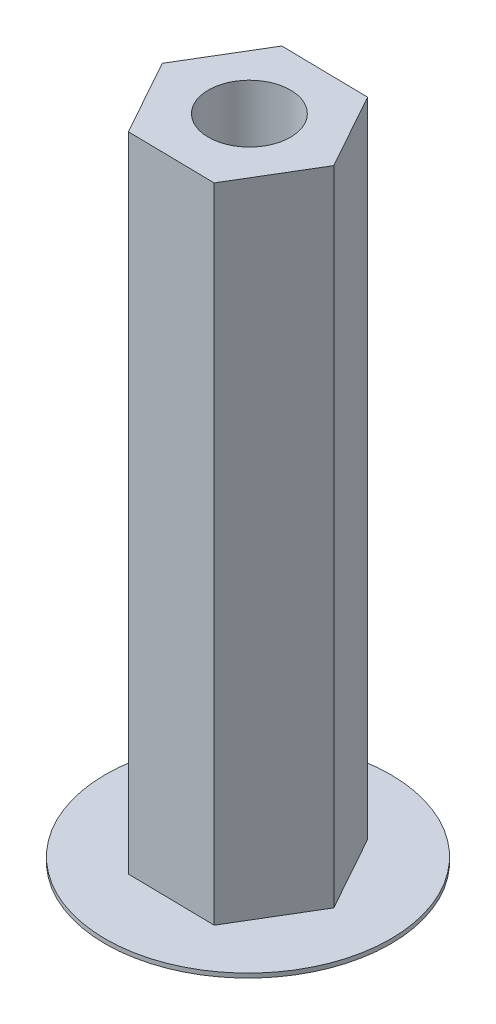
ISO-10303-21;
HEADER;
FILE_DESCRIPTION(('STEP AP214'),'2;1');
FILE_NAME('part.step','',(''),(''),'','','');
FILE_SCHEMA(('AUTOMOTIVE_DESIGN { 1 0 10303 214 1 1 1 1 }'));
ENDSEC;
DATA;
#1=APPLICATION_CONTEXT('core data for automotive mechanical design processes');
#2=APPLICATION_PROTOCOL_DEFINITION('international standard','automotive_design',2000,#1);
#3=PRODUCT_CONTEXT('',#1,'mechanical');
#4=PRODUCT('Part','Part','',(#3));
#5=PRODUCT_RELATED_PRODUCT_CATEGORY('part','',(#4));
#6=PRODUCT_DEFINITION_FORMATION('','',#4);
#7=PRODUCT_DEFINITION_CONTEXT('part definition',#1,'design');
#8=PRODUCT_DEFINITION('design','',#6,#7);
#9=PRODUCT_DEFINITION_SHAPE('','',#8);
#10=(LENGTH_UNIT() NAMED_UNIT(*) SI_UNIT(.MILLI.,.METRE.));
#11=(NAMED_UNIT(*) PLANE_ANGLE_UNIT() SI_UNIT($,.RADIAN.));
#12=(NAMED_UNIT(*) SI_UNIT($,.STERADIAN.) SOLID_ANGLE_UNIT());
#13=UNCERTAINTY_MEASURE_WITH_UNIT(LENGTH_MEASURE(1.E-05),#10,'distance_accuracy_value','');
#14=(GEOMETRIC_REPRESENTATION_CONTEXT(3) GLOBAL_UNCERTAINTY_ASSIGNED_CONTEXT((#13)) GLOBAL_UNIT_ASSIGNED_CONTEXT((#10,
#11,#12)) REPRESENTATION_CONTEXT('',''));
#15=CARTESIAN_POINT('',(0.,0.,0.));
#16=DIRECTION('',(0.,0.,1.));
#17=DIRECTION('',(1.,0.,0.));
#18=AXIS2_PLACEMENT_3D('',#15,#16,#17);
#19=CARTESIAN_POINT('',(-2.07676374644697,30.,3.4670427852533));
#20=DIRECTION('',(0.0160854988047918,0.,-0.999870619994508));
#21=DIRECTION('',(-0.999870619994508,0.,-0.0160854988047918));
#22=AXIS2_PLACEMENT_3D('',#19,#20,#21);
#23=PLANE('',#22);
#24=DIRECTION('',(-0.999870619994508,0.,-0.0160854988047918));
#25=VECTOR('',#24,1.);
#26=CARTESIAN_POINT('',(-2.07676374644697,0.199999999999999,3.4670427852533));
#27=LINE('',#26,#25);
#28=CARTESIAN_POINT('',(1.96416525481343,0.199999999999999,3.53205155470827));
#29=VERTEX_POINT('',#28);
#30=CARTESIAN_POINT('',(-2.07676374644697,0.199999999999999,3.4670427852533));
#31=VERTEX_POINT('',#30);
#32=EDGE_CURVE('E47',#29,#31,#27,.T.);
#33=ORIENTED_EDGE('',*,*,#32,.F.);
#34=DIRECTION('',(0.,-1.,0.));
#35=VECTOR('',#34,1.);
#36=CARTESIAN_POINT('',(1.96416525481343,30.,3.53205155470827));
#37=LINE('',#36,#35);
#38=CARTESIAN_POINT('',(1.96416525481343,30.,3.53205155470827));
#39=VERTEX_POINT('',#38);
#40=EDGE_CURVE('E11',#39,#29,#37,.T.);
#41=ORIENTED_EDGE('',*,*,#40,.F.);
#42=DIRECTION('',(0.999870619994508,0.,0.0160854988047918));
#43=VECTOR('',#42,1.);
#44=CARTESIAN_POINT('',(-2.07676374644697,30.,3.4670427852533));
#45=LINE('',#44,#43);
#46=CARTESIAN_POINT('',(-2.07676374644697,30.,3.4670427852533));
#47=VERTEX_POINT('',#46);
#48=EDGE_CURVE('E127',#47,#39,#45,.T.);
#49=ORIENTED_EDGE('',*,*,#48,.F.);
#50=DIRECTION('',(0.,-1.,0.));
#51=VECTOR('',#50,1.);
#52=CARTESIAN_POINT('',(-2.07676374644697,30.,3.4670427852533));
#53=LINE('',#52,#51);
#54=EDGE_CURVE('E97',#47,#31,#53,.T.);
#55=ORIENTED_EDGE('',*,*,#54,.T.);
#56=EDGE_LOOP('',(#33,#41,#49,#55));
#57=FACE_BOUND('',#56,.T.);
#58=ADVANCED_FACE('F33',(#57),#23,.F.);
#59=CARTESIAN_POINT('',(1.96416525481343,30.,3.53205155470827));
#60=DIRECTION('',(-0.857870608010546,0.,-0.513865760594746));
#61=DIRECTION('',(-0.513865760594746,0.,0.857870608010546));
#62=AXIS2_PLACEMENT_3D('',#59,#60,#61);
#63=PLANE('',#62);
#64=DIRECTION('',(-0.513865760594746,0.,0.857870608010546));
#65=VECTOR('',#64,1.);
#66=CARTESIAN_POINT('',(1.96416525481343,0.199999999999999,3.53205155470827));
#67=LINE('',#66,#65);
#68=CARTESIAN_POINT('',(4.04092900126038,0.199999999999999,0.065008769454972));
#69=VERTEX_POINT('',#68);
#70=EDGE_CURVE('E53',#69,#29,#67,.T.);
#71=ORIENTED_EDGE('',*,*,#70,.F.);
#72=DIRECTION('',(0.,-1.,0.));
#73=VECTOR('',#72,1.);
#74=CARTESIAN_POINT('',(4.04092900126038,30.,0.065008769454972));
#75=LINE('',#74,#73);
#76=CARTESIAN_POINT('',(4.04092900126038,30.,0.065008769454972));
#77=VERTEX_POINT('',#76);
#78=EDGE_CURVE('E40',#77,#69,#75,.T.);
#79=ORIENTED_EDGE('',*,*,#78,.F.);
#80=DIRECTION('',(0.513865760594746,0.,-0.857870608010546));
#81=VECTOR('',#80,1.);
#82=CARTESIAN_POINT('',(1.96416525481343,30.,3.53205155470827));
#83=LINE('',#82,#81);
#84=EDGE_CURVE('E132',#39,#77,#83,.T.);
#85=ORIENTED_EDGE('',*,*,#84,.F.);
#86=ORIENTED_EDGE('',*,*,#40,.T.);
#87=EDGE_LOOP('',(#71,#79,#85,#86));
#88=FACE_BOUND('',#87,.T.);
#89=ADVANCED_FACE('F156',(#88),#63,.F.);
#90=CARTESIAN_POINT('',(4.04092900126038,30.,0.065008769454972));
#91=DIRECTION('',(-0.873956106815336,0.,0.48600485939976));
#92=DIRECTION('',(0.48600485939976,0.,0.873956106815336));
#93=AXIS2_PLACEMENT_3D('',#90,#91,#92);
#94=PLANE('',#93);
#95=DIRECTION('',(0.48600485939976,0.,0.873956106815336));
#96=VECTOR('',#95,1.);
#97=CARTESIAN_POINT('',(4.04092900126038,0.199999999999999,0.065008769454972));
#98=LINE('',#97,#96);
#99=CARTESIAN_POINT('',(2.07676374644695,0.199999999999999,-3.4670427852533));
#100=VERTEX_POINT('',#99);
#101=EDGE_CURVE('E118',#100,#69,#98,.T.);
#102=ORIENTED_EDGE('',*,*,#101,.F.);
#103=DIRECTION('',(0.,-1.,0.));
#104=VECTOR('',#103,1.);
#105=CARTESIAN_POINT('',(2.07676374644695,30.,-3.4670427852533));
#106=LINE('',#105,#104);
#107=CARTESIAN_POINT('',(2.07676374644695,30.,-3.4670427852533));
#108=VERTEX_POINT('',#107);
#109=EDGE_CURVE('E143',#108,#100,#106,.T.);
#110=ORIENTED_EDGE('',*,*,#109,.F.);
#111=DIRECTION('',(-0.48600485939976,0.,-0.873956106815336));
#112=VECTOR('',#111,1.);
#113=CARTESIAN_POINT('',(4.04092900126038,30.,0.065008769454972));
#114=LINE('',#113,#112);
#115=EDGE_CURVE('E134',#77,#108,#114,.T.);
#116=ORIENTED_EDGE('',*,*,#115,.F.);
#117=ORIENTED_EDGE('',*,*,#78,.T.);
#118=EDGE_LOOP('',(#102,#110,#116,#117));
#119=FACE_BOUND('',#118,.T.);
#120=ADVANCED_FACE('F147',(#119),#94,.F.);
#121=CARTESIAN_POINT('',(2.07676374644695,30.,-3.4670427852533));
#122=DIRECTION('',(-0.0160854988047911,0.,0.999870619994508));
#123=DIRECTION('',(0.999870619994508,0.,0.0160854988047911));
#124=AXIS2_PLACEMENT_3D('',#121,#122,#123);
#125=PLANE('',#124);
#126=DIRECTION('',(0.999870619994508,0.,0.0160854988047911));
#127=VECTOR('',#126,1.);
#128=CARTESIAN_POINT('',(2.07676374644695,0.199999999999999,-3.4670427852533));
#129=LINE('',#128,#127);
#130=CARTESIAN_POINT('',(-1.96416525481342,0.199999999999999,-3.53205155470827));
#131=VERTEX_POINT('',#130);
#132=EDGE_CURVE('E106',#131,#100,#129,.T.);
#133=ORIENTED_EDGE('',*,*,#132,.F.);
#134=DIRECTION('',(0.,-1.,0.));
#135=VECTOR('',#134,1.);
#136=CARTESIAN_POINT('',(-1.96416525481342,30.,-3.53205155470827));
#137=LINE('',#136,#135);
#138=CARTESIAN_POINT('',(-1.96416525481342,30.,-3.53205155470827));
#139=VERTEX_POINT('',#138);
#140=EDGE_CURVE('E96',#139,#131,#137,.T.);
#141=ORIENTED_EDGE('',*,*,#140,.F.);
#142=DIRECTION('',(-0.999870619994508,0.,-0.0160854988047911));
#143=VECTOR('',#142,1.);
#144=CARTESIAN_POINT('',(2.07676374644695,30.,-3.4670427852533));
#145=LINE('',#144,#143);
#146=EDGE_CURVE('E136',#108,#139,#145,.T.);
#147=ORIENTED_EDGE('',*,*,#146,.F.);
#148=ORIENTED_EDGE('',*,*,#109,.T.);
#149=EDGE_LOOP('',(#133,#141,#147,#148));
#150=FACE_BOUND('',#149,.T.);
#151=ADVANCED_FACE('F150',(#150),#125,.F.);
#152=CARTESIAN_POINT('',(-1.96416525481342,30.,-3.53205155470827));
#153=DIRECTION('',(0.857870608010545,0.,0.513865760594748));
#154=DIRECTION('',(0.513865760594748,0.,-0.857870608010545));
#155=AXIS2_PLACEMENT_3D('',#152,#153,#154);
#156=PLANE('',#155);
#157=DIRECTION('',(0.513865760594748,0.,-0.857870608010545));
#158=VECTOR('',#157,1.);
#159=CARTESIAN_POINT('',(-1.96416525481342,0.199999999999999,-3.53205155470827));
#160=LINE('',#159,#158);
#161=CARTESIAN_POINT('',(-4.04092900126039,0.199999999999999,-0.0650087694549707));
#162=VERTEX_POINT('',#161);
#163=EDGE_CURVE('E101',#162,#131,#160,.T.);
#164=ORIENTED_EDGE('',*,*,#163,.F.);
#165=DIRECTION('',(0.,-1.,0.));
#166=VECTOR('',#165,1.);
#167=CARTESIAN_POINT('',(-4.04092900126039,30.,-0.0650087694549707));
#168=LINE('',#167,#166);
#169=CARTESIAN_POINT('',(-4.04092900126039,30.,-0.0650087694549707));
#170=VERTEX_POINT('',#169);
#171=EDGE_CURVE('E87',#170,#162,#168,.T.);
#172=ORIENTED_EDGE('',*,*,#171,.F.);
#173=DIRECTION('',(-0.513865760594748,0.,0.857870608010544));
#174=VECTOR('',#173,1.);
#175=CARTESIAN_POINT('',(-1.96416525481342,30.,-3.53205155470827));
#176=LINE('',#175,#174);
#177=EDGE_CURVE('E138',#139,#170,#176,.T.);
#178=ORIENTED_EDGE('',*,*,#177,.F.);
#179=ORIENTED_EDGE('',*,*,#140,.T.);
#180=EDGE_LOOP('',(#164,#172,#178,#179));
#181=FACE_BOUND('',#180,.T.);
#182=ADVANCED_FACE('F102',(#181),#156,.F.);
#183=CARTESIAN_POINT('',(-4.04092900126039,30.,-0.0650087694549707));
#184=DIRECTION('',(0.873956106815336,0.,-0.48600485939976));
#185=DIRECTION('',(-0.48600485939976,0.,-0.873956106815336));
#186=AXIS2_PLACEMENT_3D('',#183,#184,#185);
#187=PLANE('',#186);
#188=DIRECTION('',(-0.48600485939976,0.,-0.873956106815336));
#189=VECTOR('',#188,1.);
#190=CARTESIAN_POINT('',(-4.04092900126039,0.199999999999999,-0.0650087694549707));
#191=LINE('',#190,#189);
#192=EDGE_CURVE('E92',#31,#162,#191,.T.);
#193=ORIENTED_EDGE('',*,*,#192,.F.);
#194=ORIENTED_EDGE('',*,*,#54,.F.);
#195=DIRECTION('',(0.48600485939976,0.,0.873956106815336));
#196=VECTOR('',#195,1.);
#197=CARTESIAN_POINT('',(-4.04092900126039,30.,-0.0650087694549707));
#198=LINE('',#197,#196);
#199=EDGE_CURVE('E93',#170,#47,#198,.T.);
#200=ORIENTED_EDGE('',*,*,#199,.F.);
#201=ORIENTED_EDGE('',*,*,#171,.T.);
#202=EDGE_LOOP('',(#193,#194,#200,#201));
#203=FACE_BOUND('',#202,.T.);
#204=ADVANCED_FACE('F89',(#203),#187,.F.);
#205=CARTESIAN_POINT('',(0.,30.,0.));
#206=DIRECTION('',(0.,1.,0.));
#207=DIRECTION('',(0.,0.,1.));
#208=AXIS2_PLACEMENT_3D('',#205,#206,#207);
#209=PLANE('',#208);
#210=ORIENTED_EDGE('',*,*,#48,.T.);
#211=ORIENTED_EDGE('',*,*,#84,.T.);
#212=ORIENTED_EDGE('',*,*,#115,.T.);
#213=ORIENTED_EDGE('',*,*,#146,.T.);
#214=ORIENTED_EDGE('',*,*,#177,.T.);
#215=ORIENTED_EDGE('',*,*,#199,.T.);
#216=EDGE_LOOP('',(#210,#211,#212,#213,#214,#215));
#217=FACE_BOUND('',#216,.T.);
#218=CARTESIAN_POINT('',(0.,30.,-0.0650087694549707));
#219=DIRECTION('',(0.,1.,0.));
#220=DIRECTION('',(0.,0.,1.));
#221=AXIS2_PLACEMENT_3D('',#218,#219,#220);
#222=CIRCLE('',#221,1.9);
#223=CARTESIAN_POINT('',(0.,30.,1.83499123054503));
#224=VERTEX_POINT('',#223);
#225=EDGE_CURVE('E124',#224,#224,#222,.T.);
#226=ORIENTED_EDGE('',*,*,#225,.F.);
#227=EDGE_LOOP('',(#226));
#228=FACE_BOUND('',#227,.T.);
#229=ADVANCED_FACE('F153',(#217,#228),#209,.T.);
#230=CARTESIAN_POINT('',(0.,0.,0.));
#231=DIRECTION('',(0.,1.,0.));
#232=DIRECTION('',(0.,0.,1.));
#233=AXIS2_PLACEMENT_3D('',#230,#231,#232);
#234=PLANE('',#233);
#235=CARTESIAN_POINT('',(0.,0.,-0.0650087694549707));
#236=DIRECTION('',(0.,1.,0.));
#237=DIRECTION('',(0.,0.,1.));
#238=AXIS2_PLACEMENT_3D('',#235,#236,#237);
#239=CIRCLE('',#238,1.9);
#240=CARTESIAN_POINT('',(0.,0.,1.83499123054503));
#241=VERTEX_POINT('',#240);
#242=EDGE_CURVE('E123',#241,#241,#239,.T.);
#243=ORIENTED_EDGE('',*,*,#242,.T.);
#244=EDGE_LOOP('',(#243));
#245=FACE_BOUND('',#244,.T.);
#246=CARTESIAN_POINT('',(0.,0.,0.));
#247=DIRECTION('',(0.,-1.,0.));
#248=DIRECTION('',(0.,0.,-1.));
#249=AXIS2_PLACEMENT_3D('',#246,#247,#248);
#250=CIRCLE('',#249,6.60737641932109);
#251=CARTESIAN_POINT('',(0.,0.,-6.60737641932109));
#252=VERTEX_POINT('',#251);
#253=EDGE_CURVE('E113',#252,#252,#250,.T.);
#254=ORIENTED_EDGE('',*,*,#253,.T.);
#255=EDGE_LOOP('',(#254));
#256=FACE_BOUND('',#255,.T.);
#257=ADVANCED_FACE('F173',(#245,#256),#234,.F.);
#258=CARTESIAN_POINT('',(0.,30.,-0.0650087694549707));
#259=DIRECTION('',(0.,-1.,0.));
#260=DIRECTION('',(0.,0.,-1.));
#261=AXIS2_PLACEMENT_3D('',#258,#259,#260);
#262=CYLINDRICAL_SURFACE('',#261,1.9);
#263=ORIENTED_EDGE('',*,*,#242,.F.);
#264=EDGE_LOOP('',(#263));
#265=FACE_BOUND('',#264,.T.);
#266=ORIENTED_EDGE('',*,*,#225,.T.);
#267=EDGE_LOOP('',(#266));
#268=FACE_BOUND('',#267,.T.);
#269=ADVANCED_FACE('F176',(#265,#268),#262,.F.);
#270=CARTESIAN_POINT('',(0.,0.2,0.));
#271=DIRECTION('',(0.,-1.,0.));
#272=DIRECTION('',(0.,0.,-1.));
#273=AXIS2_PLACEMENT_3D('',#270,#271,#272);
#274=CYLINDRICAL_SURFACE('',#273,6.60737641932109);
#275=CARTESIAN_POINT('',(0.,0.2,0.));
#276=DIRECTION('',(0.,-1.,0.));
#277=DIRECTION('',(0.,0.,-1.));
#278=AXIS2_PLACEMENT_3D('',#275,#276,#277);
#279=CIRCLE('',#278,6.60737641932109);
#280=CARTESIAN_POINT('',(0.,0.2,-6.60737641932109));
#281=VERTEX_POINT('',#280);
#282=EDGE_CURVE('E110',#281,#281,#279,.T.);
#283=ORIENTED_EDGE('',*,*,#282,.T.);
#284=EDGE_LOOP('',(#283));
#285=FACE_BOUND('',#284,.T.);
#286=ORIENTED_EDGE('',*,*,#253,.F.);
#287=EDGE_LOOP('',(#286));
#288=FACE_BOUND('',#287,.T.);
#289=ADVANCED_FACE('F182',(#285,#288),#274,.T.);
#290=CARTESIAN_POINT('',(0.,0.2,0.));
#291=DIRECTION('',(0.,-1.,0.));
#292=DIRECTION('',(0.,0.,-1.));
#293=AXIS2_PLACEMENT_3D('',#290,#291,#292);
#294=PLANE('',#293);
#295=ORIENTED_EDGE('',*,*,#70,.T.);
#296=ORIENTED_EDGE('',*,*,#32,.T.);
#297=ORIENTED_EDGE('',*,*,#192,.T.);
#298=ORIENTED_EDGE('',*,*,#163,.T.);
#299=ORIENTED_EDGE('',*,*,#132,.T.);
#300=ORIENTED_EDGE('',*,*,#101,.T.);
#301=EDGE_LOOP('',(#295,#296,#297,#298,#299,#300));
#302=FACE_BOUND('',#301,.T.);
#303=ORIENTED_EDGE('',*,*,#282,.F.);
#304=EDGE_LOOP('',(#303));
#305=FACE_BOUND('',#304,.T.);
#306=ADVANCED_FACE('F108',(#302,#305),#294,.F.);
#307=CLOSED_SHELL('',(#58,#89,#120,#151,#182,#204,#229,#257,#269,#289,#306));
#308=MANIFOLD_SOLID_BREP('B2',#307);
#309=ADVANCED_BREP_SHAPE_REPRESENTATION('',(#18,#308),#14);
#310=SHAPE_DEFINITION_REPRESENTATION(#9,#309);
ENDSEC;
END-ISO-10303-21;
